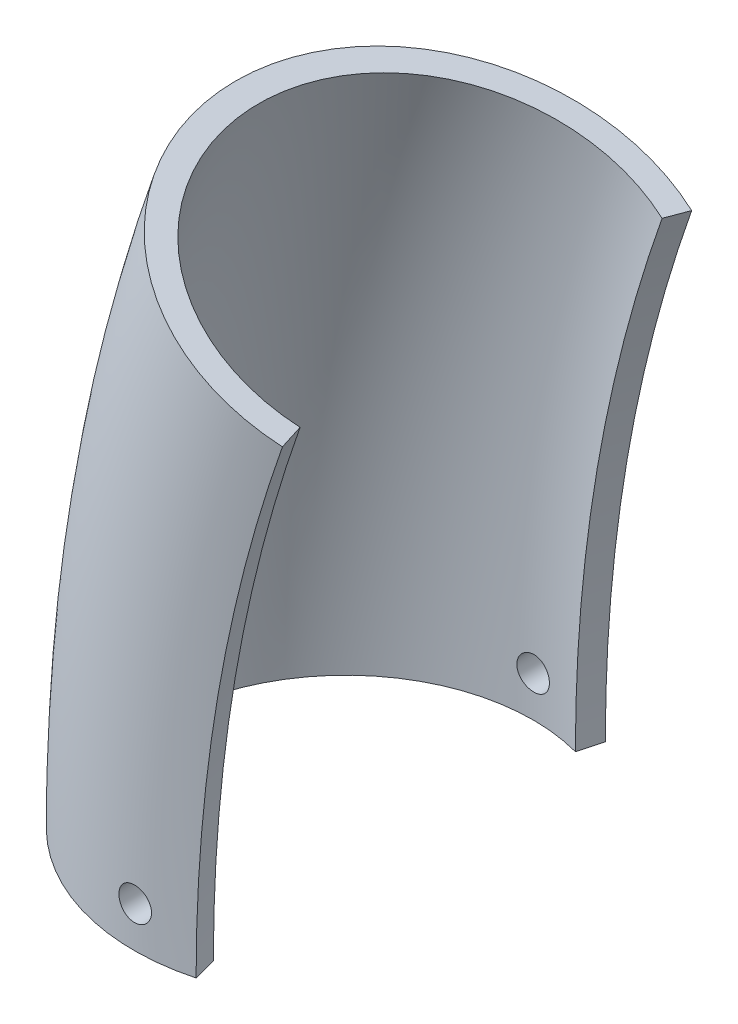
ISO-10303-21;
HEADER;
FILE_DESCRIPTION(('STEP AP214'),'2;1');
FILE_NAME('part.step','',(''),(''),'','','');
FILE_SCHEMA(('AUTOMOTIVE_DESIGN { 1 0 10303 214 1 1 1 1 }'));
ENDSEC;
DATA;
#1=APPLICATION_CONTEXT('core data for automotive mechanical design processes');
#2=APPLICATION_PROTOCOL_DEFINITION('international standard','automotive_design',2000,#1);
#3=PRODUCT_CONTEXT('',#1,'mechanical');
#4=PRODUCT('Part','Part','',(#3));
#5=PRODUCT_RELATED_PRODUCT_CATEGORY('part','',(#4));
#6=PRODUCT_DEFINITION_FORMATION('','',#4);
#7=PRODUCT_DEFINITION_CONTEXT('part definition',#1,'design');
#8=PRODUCT_DEFINITION('design','',#6,#7);
#9=PRODUCT_DEFINITION_SHAPE('','',#8);
#10=(LENGTH_UNIT() NAMED_UNIT(*) SI_UNIT(.MILLI.,.METRE.));
#11=(NAMED_UNIT(*) PLANE_ANGLE_UNIT() SI_UNIT($,.RADIAN.));
#12=(NAMED_UNIT(*) SI_UNIT($,.STERADIAN.) SOLID_ANGLE_UNIT());
#13=UNCERTAINTY_MEASURE_WITH_UNIT(LENGTH_MEASURE(1.E-05),#10,'distance_accuracy_value','');
#14=(GEOMETRIC_REPRESENTATION_CONTEXT(3) GLOBAL_UNCERTAINTY_ASSIGNED_CONTEXT((#13)) GLOBAL_UNIT_ASSIGNED_CONTEXT((#10,
#11,#12)) REPRESENTATION_CONTEXT('',''));
#15=CARTESIAN_POINT('',(0.,0.,0.));
#16=DIRECTION('',(0.,0.,1.));
#17=DIRECTION('',(1.,0.,0.));
#18=AXIS2_PLACEMENT_3D('',#15,#16,#17);
#19=CARTESIAN_POINT('',(0.,0.,0.));
#20=DIRECTION('',(0.,1.,0.));
#21=DIRECTION('',(0.,0.,1.));
#22=AXIS2_PLACEMENT_3D('',#19,#20,#21);
#23=PLANE('',#22);
#24=CARTESIAN_POINT('',(0.,0.,0.));
#25=DIRECTION('',(0.,-1.,0.));
#26=DIRECTION('',(0.,0.,1.));
#27=AXIS2_PLACEMENT_3D('',#24,#25,#26);
#28=CIRCLE('',#27,73.025);
#29=CARTESIAN_POINT('',(18.9002607686114,0.,70.5367334647593));
#30=VERTEX_POINT('',#29);
#31=CARTESIAN_POINT('',(18.9002607686114,0.,-70.5367334647593));
#32=VERTEX_POINT('',#31);
#33=EDGE_CURVE('E97',#30,#32,#28,.T.);
#34=ORIENTED_EDGE('',*,*,#33,.F.);
#35=DIRECTION('',(-0.258819045102518,0.,-0.965925826289069));
#36=VECTOR('',#35,1.);
#37=CARTESIAN_POINT('',(18.9002607686114,0.,70.5367334647593));
#38=LINE('',#37,#36);
#39=CARTESIAN_POINT('',(21.3655121732128,0.,79.7371769601627));
#40=VERTEX_POINT('',#39);
#41=EDGE_CURVE('E101',#40,#30,#38,.T.);
#42=ORIENTED_EDGE('',*,*,#41,.F.);
#43=CARTESIAN_POINT('',(0.,0.,0.));
#44=DIRECTION('',(0.,1.,0.));
#45=DIRECTION('',(0.,0.,1.));
#46=AXIS2_PLACEMENT_3D('',#43,#44,#45);
#47=CIRCLE('',#46,82.55);
#48=CARTESIAN_POINT('',(21.3655121732128,0.,-79.7371769601627));
#49=VERTEX_POINT('',#48);
#50=EDGE_CURVE('E104',#49,#40,#47,.T.);
#51=ORIENTED_EDGE('',*,*,#50,.F.);
#52=DIRECTION('',(0.258819045102518,0.,-0.965925826289069));
#53=VECTOR('',#52,1.);
#54=CARTESIAN_POINT('',(18.9002607686114,0.,-70.5367334647593));
#55=LINE('',#54,#53);
#56=EDGE_CURVE('E90',#32,#49,#55,.T.);
#57=ORIENTED_EDGE('',*,*,#56,.F.);
#58=EDGE_LOOP('',(#34,#42,#51,#57));
#59=FACE_BOUND('',#58,.T.);
#60=ADVANCED_FACE('F48',(#59),#23,.F.);
#61=CARTESIAN_POINT('',(34.8636082515742,203.2,0.));
#62=DIRECTION('',(0.333333333333333,0.942809041582063,0.));
#63=DIRECTION('',(0.,0.,1.));
#64=AXIS2_PLACEMENT_3D('',#61,#62,#63);
#65=PLANE('',#64);
#66=CARTESIAN_POINT('',(34.8636082515742,203.2,0.));
#67=DIRECTION('',(-0.333333333333333,-0.942809041582063,0.));
#68=DIRECTION('',(0.,0.,1.));
#69=AXIS2_PLACEMENT_3D('',#66,#67,#68);
#70=CIRCLE('',#69,73.025);
#71=CARTESIAN_POINT('',(52.6829449924797,196.89991307713,70.5367334647593));
#72=VERTEX_POINT('',#71);
#73=CARTESIAN_POINT('',(52.6829449924797,196.89991307713,-70.5367334647593));
#74=VERTEX_POINT('',#73);
#75=EDGE_CURVE('E72',#72,#74,#70,.T.);
#76=ORIENTED_EDGE('',*,*,#75,.T.);
#77=DIRECTION('',(0.24401693585629,-0.0862730150341727,-0.965925826289069));
#78=VECTOR('',#77,1.);
#79=CARTESIAN_POINT('',(52.6829449924798,196.89991307713,-70.5367334647593));
#80=LINE('',#79,#78);
#81=CARTESIAN_POINT('',(55.0072063065109,196.078162608929,-79.7371769601627));
#82=VERTEX_POINT('',#81);
#83=EDGE_CURVE('E11',#74,#82,#80,.T.);
#84=ORIENTED_EDGE('',*,*,#83,.T.);
#85=CARTESIAN_POINT('',(34.8636082515742,203.2,0.));
#86=DIRECTION('',(0.333333333333333,0.942809041582063,0.));
#87=DIRECTION('',(0.,0.,1.));
#88=AXIS2_PLACEMENT_3D('',#85,#86,#87);
#89=CIRCLE('',#88,82.55);
#90=CARTESIAN_POINT('',(55.0072063065109,196.078162608929,79.7371769601627));
#91=VERTEX_POINT('',#90);
#92=EDGE_CURVE('E122',#82,#91,#89,.T.);
#93=ORIENTED_EDGE('',*,*,#92,.T.);
#94=DIRECTION('',(-0.24401693585629,0.0862730150341728,-0.965925826289069));
#95=VECTOR('',#94,1.);
#96=CARTESIAN_POINT('',(52.6829449924798,196.89991307713,70.5367334647593));
#97=LINE('',#96,#95);
#98=EDGE_CURVE('E78',#91,#72,#97,.T.);
#99=ORIENTED_EDGE('',*,*,#98,.T.);
#100=EDGE_LOOP('',(#76,#84,#93,#99));
#101=FACE_BOUND('',#100,.T.);
#102=ADVANCED_FACE('F184',(#101),#65,.T.);
#103=CARTESIAN_POINT('',(609.6,0.,0.));
#104=DIRECTION('',(0.,0.,-1.));
#105=DIRECTION('',(-1.,0.,0.));
#106=AXIS2_PLACEMENT_3D('',#103,#104,#105);
#107=TOROIDAL_SURFACE('',#106,609.6,82.55);
#108=CARTESIAN_POINT('',(-4.32866974903977,11.4306157597218,-82.4307747753706));
#109=CARTESIAN_POINT('',(-4.45349599501136,11.5579964452513,-82.423932353531));
#110=CARTESIAN_POINT('',(-4.57293425013868,11.690622181437,-82.4170770402688));
#111=CARTESIAN_POINT('',(-4.80026798103986,11.9655023488514,-82.4035289042621));
#112=CARTESIAN_POINT('',(-4.908160583175,12.1077591628758,-82.3968361222894));
#113=CARTESIAN_POINT('',(-5.11167746680809,12.4009811623383,-82.3837977144483));
#114=CARTESIAN_POINT('',(-5.20729142461335,12.5519535230889,-82.3774523832487));
#115=CARTESIAN_POINT('',(-5.38550073157508,12.8614907400153,-82.3652908810197));
#116=CARTESIAN_POINT('',(-5.46809132723144,13.0200583410328,-82.3594749035292));
#117=CARTESIAN_POINT('',(-5.61956547891059,13.3434942206817,-82.3485424190019));
#118=CARTESIAN_POINT('',(-5.68845886752114,13.5083578775802,-82.3434254110391));
#119=CARTESIAN_POINT('',(-5.81214137858058,13.8433862842894,-82.33402817327));
#120=CARTESIAN_POINT('',(-5.86692529326976,14.0135529655251,-82.3297482525696));
#121=CARTESIAN_POINT('',(-5.96193061228865,14.3578122393139,-82.3221505752256));
#122=CARTESIAN_POINT('',(-6.00216096947484,14.5319023480396,-82.3188322273057));
#123=CARTESIAN_POINT('',(-6.06782699775818,14.8829342212113,-82.3132467080471));
#124=CARTESIAN_POINT('',(-6.09325721612157,15.0598770120127,-82.3109799241926));
#125=CARTESIAN_POINT('',(-6.12907651595348,15.4149086036543,-82.3075670011064));
#126=CARTESIAN_POINT('',(-6.13949748455716,15.5929941651876,-82.3064184877982));
#127=CARTESIAN_POINT('',(-6.14532528711514,15.9494804616701,-82.3052658234617));
#128=CARTESIAN_POINT('',(-6.14072657944947,16.1278812886699,-82.3052620948583));
#129=CARTESIAN_POINT('',(-6.11653971010502,16.4835991890116,-82.3063999745408));
#130=CARTESIAN_POINT('',(-6.09695664335805,16.6609166100773,-82.3075411935664));
#131=CARTESIAN_POINT('',(-6.04293871742971,17.0133306632782,-82.3109368765231));
#132=CARTESIAN_POINT('',(-6.00849837630483,17.1884264511174,-82.3131917514085));
#133=CARTESIAN_POINT('',(-5.92508571163942,17.5347821981685,-82.3187466678352));
#134=CARTESIAN_POINT('',(-5.87613881116522,17.7060483089004,-82.3220448815775));
#135=CARTESIAN_POINT('',(-5.76402493282343,18.0439060141497,-82.3295964145516));
#136=CARTESIAN_POINT('',(-5.70085272202916,18.2104958630291,-82.3338500852565));
#137=CARTESIAN_POINT('',(-5.5607644220864,18.5377108121363,-82.3431918058656));
#138=CARTESIAN_POINT('',(-5.48385330670053,18.6983380456192,-82.3482795537622));
#139=CARTESIAN_POINT('',(-5.31683196415711,19.01257313007,-82.3591473132793));
#140=CARTESIAN_POINT('',(-5.22671686315961,19.1661783614976,-82.3649275803775));
#141=CARTESIAN_POINT('',(-4.93717160401494,19.6152348205213,-82.3830883717606));
#142=CARTESIAN_POINT('',(-4.71865174392845,19.8986698511481,-82.3962811754801));
#143=CARTESIAN_POINT('',(-4.23732823759203,20.4247303021176,-82.4233435328099));
#144=CARTESIAN_POINT('',(-3.97452400123697,20.6673551785645,-82.4372130954365));
#145=CARTESIAN_POINT('',(-3.41128757208801,21.1056696475768,-82.4641205177042));
#146=CARTESIAN_POINT('',(-3.11077390362521,21.3012548527819,-82.4771564812989));
#147=CARTESIAN_POINT('',(-2.48109399033172,21.6391775688171,-82.5008995807081));
#148=CARTESIAN_POINT('',(-2.15192788677827,21.7815153421771,-82.5116067280043));
#149=CARTESIAN_POINT('',(-1.47455384404525,22.0087793642633,-82.5294764998027));
#150=CARTESIAN_POINT('',(-1.12636233798533,22.0937543383445,-82.536642131165));
#151=CARTESIAN_POINT('',(-0.420595515642418,22.2040214508361,-82.5466263332644));
#152=CARTESIAN_POINT('',(-0.0630203720252275,22.2293146866567,-82.5494449839323));
#153=CARTESIAN_POINT('',(0.650370291559263,22.2194951258999,-82.5504043967984));
#154=CARTESIAN_POINT('',(1.00618796869224,22.1845395967127,-82.5485573320599));
#155=CARTESIAN_POINT('',(1.70688820866638,22.0555310457813,-82.540406856769));
#156=CARTESIAN_POINT('',(2.05177079237753,21.9614781368336,-82.5341034547223));
#157=CARTESIAN_POINT('',(2.72072071579783,21.7170185159034,-82.5177420220277));
#158=CARTESIAN_POINT('',(3.04479480676612,21.5666301911261,-82.5076852164499));
#159=CARTESIAN_POINT('',(3.66313162433366,21.2137806772622,-82.4849401876146));
#160=CARTESIAN_POINT('',(3.95739384447539,21.01131860373,-82.4722519196639));
#161=CARTESIAN_POINT('',(4.50854072734592,20.5594757366249,-82.4456341549783));
#162=CARTESIAN_POINT('',(4.76533061900134,20.3099795167002,-82.4317016499979));
#163=CARTESIAN_POINT('',(5.23342944172025,19.7714331071113,-82.4041993450182));
#164=CARTESIAN_POINT('',(5.44473792506236,19.4823825281177,-82.3906295485906));
#165=CARTESIAN_POINT('',(5.81616327209498,18.8724253980708,-82.3653784114299));
#166=CARTESIAN_POINT('',(5.97620650217115,18.5514738855585,-82.3536997988441));
#167=CARTESIAN_POINT('',(6.2401049821455,17.8871512944842,-82.3335952075076));
#168=CARTESIAN_POINT('',(6.34396100846702,17.5437805257963,-82.3251691838114));
#169=CARTESIAN_POINT('',(6.49234271193337,16.8450620908956,-82.3125542291682));
#170=CARTESIAN_POINT('',(6.53698171165381,16.4897386390167,-82.3083572089654));
#171=CARTESIAN_POINT('',(6.56599854086009,15.7766171072048,-82.3046566186948));
#172=CARTESIAN_POINT('',(6.55037727256438,15.4188190644015,-82.3051529783577));
#173=CARTESIAN_POINT('',(6.45943273351659,14.7117641901717,-82.3107748962818));
#174=CARTESIAN_POINT('',(6.38424506758292,14.3624898138029,-82.3158899436443));
#175=CARTESIAN_POINT('',(6.17648547747823,13.6815228137756,-82.3301474635966));
#176=CARTESIAN_POINT('',(6.04391320809156,13.3498302958999,-82.339289960415));
#177=CARTESIAN_POINT('',(5.72506712987742,12.7131100005873,-82.3605649907169));
#178=CARTESIAN_POINT('',(5.53874148051283,12.4081083360577,-82.3727004089697));
#179=CARTESIAN_POINT('',(5.1175258518709,11.8335403219248,-82.3985834505632));
#180=CARTESIAN_POINT('',(4.88263491328413,11.5639746724607,-82.4123311057481));
#181=CARTESIAN_POINT('',(4.49888972392682,11.1918393142398,-82.4329957923471));
#182=CARTESIAN_POINT('',(4.36546172081753,11.0729717681654,-82.4399041367886));
#183=CARTESIAN_POINT('',(4.08907781889291,10.8469017416686,-82.4535350309164));
#184=CARTESIAN_POINT('',(3.94612544169336,10.7396949878699,-82.4602576479885));
#185=CARTESIAN_POINT('',(3.65163892929388,10.5376701625698,-82.4733284770764));
#186=CARTESIAN_POINT('',(3.50010160545203,10.4428567380482,-82.4796765481665));
#187=CARTESIAN_POINT('',(3.18961361906801,10.2663601757284,-82.4918132766045));
#188=CARTESIAN_POINT('',(3.03066572891573,10.1846721775903,-82.4976021407084));
#189=CARTESIAN_POINT('',(2.70633961112467,10.0349290994089,-82.5084618004921));
#190=CARTESIAN_POINT('',(2.54095776656495,9.96688182385363,-82.5135321846128));
#191=CARTESIAN_POINT('',(2.20508603529255,9.84498999222211,-82.5228055466132));
#192=CARTESIAN_POINT('',(2.03459806964054,9.7911401676083,-82.5270088461333));
#193=CARTESIAN_POINT('',(1.6896140508986,9.69798452745115,-82.5344328800551));
#194=CARTESIAN_POINT('',(1.51511673108588,9.65868337746059,-82.537653299203));
#195=CARTESIAN_POINT('',(1.16347869088376,9.59494677947494,-82.5430181751958));
#196=CARTESIAN_POINT('',(0.986338980970456,9.57050579091745,-82.5451630330077));
#197=CARTESIAN_POINT('',(0.631025428606752,9.53668335544785,-82.5483152926069));
#198=CARTESIAN_POINT('',(0.452854865053528,9.52726769795267,-82.549325276786));
#199=CARTESIAN_POINT('',(0.0964165492174945,9.52345826282207,-82.5501892612614));
#200=CARTESIAN_POINT('',(-0.0818511424097894,9.52905890846177,-82.5500436906658));
#201=CARTESIAN_POINT('',(-0.437385422794162,9.55523791775793,-82.5486027903748));
#202=CARTESIAN_POINT('',(-0.614651352537175,9.57582519421733,-82.5473067763905));
#203=CARTESIAN_POINT('',(-0.966746169785933,9.63182823904427,-82.5436029222853));
#204=CARTESIAN_POINT('',(-1.14157593043828,9.66723854567225,-82.5411954916467));
#205=CARTESIAN_POINT('',(-1.48754388783043,9.75261235620044,-82.5353396654393));
#206=CARTESIAN_POINT('',(-1.65868371021568,9.80256930463214,-82.5318917387463));
#207=CARTESIAN_POINT('',(-1.99607726150443,9.91666170072117,-82.5240544360274));
#208=CARTESIAN_POINT('',(-2.16233274372493,9.98079198838541,-82.5196654026411));
#209=CARTESIAN_POINT('',(-2.48871730897951,10.1227270219954,-82.5100733265165));
#210=CARTESIAN_POINT('',(-2.64885129835386,10.2005205247505,-82.5048709534431));
#211=CARTESIAN_POINT('',(-2.96195864479264,10.3692329784696,-82.4937982719921));
#212=CARTESIAN_POINT('',(-3.11493374314078,10.4601487154587,-82.4879281272435));
#213=CARTESIAN_POINT('',(-3.45641727025332,10.683022223844,-82.4738846603695));
#214=CARTESIAN_POINT('',(-3.64218650943381,10.8191962789997,-82.4655408253686));
#215=CARTESIAN_POINT('',(-3.99784575010048,11.1108793346777,-82.4483967287713));
#216=CARTESIAN_POINT('',(-4.16773571590569,11.2663883786442,-82.4395964661494));
#217=CARTESIAN_POINT('',(-4.32866974903977,11.4306157597218,-82.4307747753706));
#218=B_SPLINE_CURVE_WITH_KNOTS('',3,(#108,#109,#110,#111,#112,#113,#114,#115,#116,#117,#118,
#119,#120,#121,#122,#123,#124,#125,#126,#127,#128,#129,#130,#131,#132,#133,#134,#135,#136,#137,
#138,#139,#140,#141,#142,#143,#144,#145,#146,#147,#148,#149,#150,#151,#152,#153,#154,#155,#156,
#157,#158,#159,#160,#161,#162,#163,#164,#165,#166,#167,#168,#169,#170,#171,#172,#173,#174,#175,
#176,#177,#178,#179,#180,#181,#182,#183,#184,#185,#186,#187,#188,#189,#190,#191,#192,#193,#194,
#195,#196,#197,#198,#199,#200,#201,#202,#203,#204,#205,#206,#207,#208,#209,#210,#211,#212,#213,
#214,#215,#216,#217),.UNSPECIFIED.,.T.,.F.,(4,2,2,2,2,2,2,2,2,2,2,2,2,2,2,2,2,2,2,2,2,2,2,2,2,2,
2,2,2,2,2,2,2,2,2,2,2,2,2,2,2,2,2,2,2,2,2,2,2,2,2,2,2,2,4),(0.,0.53523264512552,
1.07059819787699,1.60641097093246,2.14241886409263,2.67804058170519,3.21385971309624,
3.74934866389685,4.28503477725967,4.81958113877571,5.35432474737836,5.88888661499353,
6.42364589080655,6.95747347575495,7.49149775640109,8.02532909976707,8.55935798907173,
9.62824440685096,10.69714506905,11.7683963202716,12.8396422897487,13.9099771680235,
14.9802923651439,16.0478179472103,17.1153414917476,18.1825169125378,19.2497104599464,
20.3195579261057,21.3894159234183,22.460803765895,23.5321768030121,24.6014966005761,
25.6708003883156,26.7376768425387,27.8045597149914,28.8724749641629,29.9404113098641,
30.476380904543,31.0121534138134,31.5481262425785,32.0839001411383,32.6199797112438,
33.1558600664757,33.6919121223402,34.2277641901946,34.7623944478632,35.2968261831108,
35.8315760138865,36.3661289822771,36.9004414253198,37.4345596642938,37.9682404296811,
38.5017907039454,39.1918455399953,39.8819019265718),.UNSPECIFIED.);
#219=CARTESIAN_POINT('',(-4.32866974903977,11.4306157597218,-82.4307747753706));
#220=VERTEX_POINT('',#219);
#221=EDGE_CURVE('E110',#220,#220,#218,.T.);
#222=ORIENTED_EDGE('',*,*,#221,.F.);
#223=EDGE_LOOP('',(#222));
#224=FACE_BOUND('',#223,.T.);
#225=CARTESIAN_POINT('',(-4.32866974903977,11.4306157597218,82.4307747753706));
#226=CARTESIAN_POINT('',(-4.20386554285281,11.3032532550161,82.4376161195338));
#227=CARTESIAN_POINT('',(-4.07370915264304,11.1811689278601,82.4444427352151));
#228=CARTESIAN_POINT('',(-3.80353693762988,10.9483407096446,82.4578789632699));
#229=CARTESIAN_POINT('',(-3.66351867821838,10.8375996355812,82.4644885214636));
#230=CARTESIAN_POINT('',(-3.37452804506166,10.6282024821753,82.4773076845398));
#231=CARTESIAN_POINT('',(-3.22554831272686,10.5295565422118,82.4835169518178));
#232=CARTESIAN_POINT('',(-2.91973459753891,10.3451223839305,82.4953564996889));
#233=CARTESIAN_POINT('',(-2.76289777516811,10.2593388594105,82.5009865686849));
#234=CARTESIAN_POINT('',(-2.44264649486017,10.1013438391072,82.5115017175215));
#235=CARTESIAN_POINT('',(-2.27923681731165,10.0291226887141,82.5163873268479));
#236=CARTESIAN_POINT('',(-1.94683222653364,9.89867066108332,82.5252811610446));
#237=CARTESIAN_POINT('',(-1.77783527692896,9.84044495011079,82.5292890618698));
#238=CARTESIAN_POINT('',(-1.43562189932873,9.73846983439129,82.5363084307282));
#239=CARTESIAN_POINT('',(-1.26240813349206,9.69471153812948,82.539320510782));
#240=CARTESIAN_POINT('',(-0.912830750623504,9.62192502310858,82.5442659168761));
#241=CARTESIAN_POINT('',(-0.736465997259152,9.59290223409205,82.5461988452965));
#242=CARTESIAN_POINT('',(-0.382296209830087,9.54986852431569,82.5489249533563));
#243=CARTESIAN_POINT('',(-0.204495153725237,9.5358250156643,82.5497206084578));
#244=CARTESIAN_POINT('',(0.15172546588937,9.52273654079223,82.5501561650581));
#245=CARTESIAN_POINT('',(0.330145233393179,9.52369711015702,82.5497956400362));
#246=CARTESIAN_POINT('',(0.686205064737938,9.54062004248928,82.5479269165496));
#247=CARTESIAN_POINT('',(0.863845372359365,9.55657732053282,82.5464191071269));
#248=CARTESIAN_POINT('',(1.21720755335119,9.60337876423419,82.5422968023463));
#249=CARTESIAN_POINT('',(1.39292869386242,9.63422842656364,82.5396818984116));
#250=CARTESIAN_POINT('',(1.74086777072017,9.71053530121787,82.5334229676288));
#251=CARTESIAN_POINT('',(1.91309068922966,9.7559699250507,82.5297805332213));
#252=CARTESIAN_POINT('',(2.25315287853854,9.86115006164636,82.5215654354889));
#253=CARTESIAN_POINT('',(2.42099051064271,9.92090084159472,82.5169924298826));
#254=CARTESIAN_POINT('',(2.75098366204603,10.0542637798237,82.5070464495991));
#255=CARTESIAN_POINT('',(2.91314120387576,10.1278709434603,82.5016737633186));
#256=CARTESIAN_POINT('',(3.23070927374089,10.2884239141298,82.490279256792));
#257=CARTESIAN_POINT('',(3.3861172825927,10.3753746475237,82.4842571970465));
#258=CARTESIAN_POINT('',(3.84104401075744,10.655701854692,82.4654455210642));
#259=CARTESIAN_POINT('',(4.12893563440712,10.868419752767,82.4519208511392));
#260=CARTESIAN_POINT('',(4.66481512008995,11.3389868656405,82.4244603689872));
#261=CARTESIAN_POINT('',(4.91280247743841,11.5968366511533,82.4105245515628));
#262=CARTESIAN_POINT('',(5.36257954194343,12.151106127111,82.3837870773871));
#263=CARTESIAN_POINT('',(5.5642720309288,12.4476049704011,82.3709878413491));
#264=CARTESIAN_POINT('',(5.91499392635277,13.0703475366138,82.3480225075936));
#265=CARTESIAN_POINT('',(6.06402373468914,13.3965910325148,82.3378563897814));
#266=CARTESIAN_POINT('',(6.30501439419046,14.069174188503,82.3213367961655));
#267=CARTESIAN_POINT('',(6.39704298345651,14.4154894585135,82.314978795237));
#268=CARTESIAN_POINT('',(6.52164567675392,15.1187046610045,82.3067906560834));
#269=CARTESIAN_POINT('',(6.55422087906463,15.4756043978349,82.3049604342167));
#270=CARTESIAN_POINT('',(6.5589726576158,16.1888567132649,82.3060378642569));
#271=CARTESIAN_POINT('',(6.53130767490701,16.5452082662675,82.3089330825048));
#272=CARTESIAN_POINT('',(6.41670820821853,17.2481834294694,82.3191044822211));
#273=CARTESIAN_POINT('',(6.32977364990827,17.5948070274682,82.3263806691839));
#274=CARTESIAN_POINT('',(6.09912708097335,18.2685495649109,82.3444801560945));
#275=CARTESIAN_POINT('',(5.9554100750031,18.5956667853974,82.3553037681073));
#276=CARTESIAN_POINT('',(5.61529084894857,19.2211656953554,82.3792629852112));
#277=CARTESIAN_POINT('',(5.41888768054728,19.5195468674651,82.392398631916));
#278=CARTESIAN_POINT('',(4.97834765029522,20.0799538673932,82.4195281624148));
#279=CARTESIAN_POINT('',(4.73408507896275,20.3418807751286,82.4335242383301));
#280=CARTESIAN_POINT('',(4.2050460414408,20.8210518067363,82.4607556287768));
#281=CARTESIAN_POINT('',(3.92026929649931,21.0382956231477,82.473990938073));
#282=CARTESIAN_POINT('',(3.31790741535797,21.4221449088503,82.4982187583542));
#283=CARTESIAN_POINT('',(3.00028835420909,21.5886973012896,82.5092089146035));
#284=CARTESIAN_POINT('',(2.34149126241702,21.8660828500397,82.5276898911438));
#285=CARTESIAN_POINT('',(2.0003135915183,21.976916856967,82.5351807648559));
#286=CARTESIAN_POINT('',(1.30487563450881,22.1394903596757,82.5458127203978));
#287=CARTESIAN_POINT('',(0.950645424039574,22.1913578897491,82.5489632296541));
#288=CARTESIAN_POINT('',(0.238494991733322,22.2349331040473,82.550601304908));
#289=CARTESIAN_POINT('',(-0.119425183729418,22.2266415434137,82.5490889294362));
#290=CARTESIAN_POINT('',(-0.82805913868248,22.1502255368299,82.5415914180256));
#291=CARTESIAN_POINT('',(-1.1787855872684,22.0822175659576,82.5356149924705));
#292=CARTESIAN_POINT('',(-1.86383640682935,21.8884758732368,82.519878171777));
#293=CARTESIAN_POINT('',(-2.1981606488636,21.7627416976722,82.5101177468971));
#294=CARTESIAN_POINT('',(-2.84136588349639,21.4569881610287,82.4878961862178));
#295=CARTESIAN_POINT('',(-3.15021327968886,21.2768985336253,82.4754315605472));
#296=CARTESIAN_POINT('',(-3.73346145532907,20.867403261736,82.4491928655802));
#297=CARTESIAN_POINT('',(-4.00786159147461,20.6379966964737,82.4354187718379));
#298=CARTESIAN_POINT('',(-4.38786002051016,20.2618201825791,82.4149237504032));
#299=CARTESIAN_POINT('',(-4.5094476257733,20.1308211889093,82.4081077587441));
#300=CARTESIAN_POINT('',(-4.74115159799363,19.8590539557096,82.3947252919891));
#301=CARTESIAN_POINT('',(-4.85127217116564,19.718289330099,82.3881587259671));
#302=CARTESIAN_POINT('',(-5.05929797437223,19.4279229528921,82.3754569528031));
#303=CARTESIAN_POINT('',(-5.15719863914913,19.278317929167,82.369321907245));
#304=CARTESIAN_POINT('',(-5.34001839212757,18.9714248334749,82.3576600649098));
#305=CARTESIAN_POINT('',(-5.42494228956688,18.8141396364642,82.3521330430106));
#306=CARTESIAN_POINT('',(-5.5812599379444,18.4929119113134,82.3418390878621));
#307=CARTESIAN_POINT('',(-5.65265032562699,18.3289677405898,82.3370723435985));
#308=CARTESIAN_POINT('',(-5.78133825377443,17.9956853608542,82.3284365694418));
#309=CARTESIAN_POINT('',(-5.83864102376568,17.8263491798806,82.3245672064584));
#310=CARTESIAN_POINT('',(-5.93879029280482,17.4833759398638,82.3178320108771));
#311=CARTESIAN_POINT('',(-5.98163215795959,17.3097375212957,82.3149664999454));
#312=CARTESIAN_POINT('',(-6.05251066684615,16.9595176983533,82.3103225824469));
#313=CARTESIAN_POINT('',(-6.08055282469112,16.7829374153981,82.3085437709558));
#314=CARTESIAN_POINT('',(-6.12160574753487,16.428439982411,82.3061246165272));
#315=CARTESIAN_POINT('',(-6.13465074825601,16.2505268141799,82.3054816787914));
#316=CARTESIAN_POINT('',(-6.14572888442474,15.8942993519511,82.3053444213328));
#317=CARTESIAN_POINT('',(-6.14376758865834,15.7159852313013,82.305849675471));
#318=CARTESIAN_POINT('',(-6.12485542488061,15.3600538844683,82.3079943568677));
#319=CARTESIAN_POINT('',(-6.10789562148754,15.1824371371134,82.3096344600874));
#320=CARTESIAN_POINT('',(-6.05910669693193,14.8293381743075,82.3140025736038));
#321=CARTESIAN_POINT('',(-6.02728304629346,14.6538551978979,82.316730183598));
#322=CARTESIAN_POINT('',(-5.94900633409018,14.3062387588628,82.3231960150189));
#323=CARTESIAN_POINT('',(-5.90255618961666,14.1341046356078,82.3269340349095));
#324=CARTESIAN_POINT('',(-5.79537925757252,13.794432585274,82.3353144454052));
#325=CARTESIAN_POINT('',(-5.73465766147786,13.6268930115414,82.3399565070453));
#326=CARTESIAN_POINT('',(-5.59941620738924,13.2976597373973,82.3500119204303));
#327=CARTESIAN_POINT('',(-5.52490767668652,13.1359613672934,82.3554246381716));
#328=CARTESIAN_POINT('',(-5.36261985080703,12.8194555317936,82.3668709140255));
#329=CARTESIAN_POINT('',(-5.2748438019018,12.6646463927145,82.3729043201541));
#330=CARTESIAN_POINT('',(-5.05890082898661,12.3185335395156,82.3872695050627));
#331=CARTESIAN_POINT('',(-4.9264479093917,12.12989078281,82.395755289254));
#332=CARTESIAN_POINT('',(-4.64185740485656,11.7681075270216,82.4130938153844));
#333=CARTESIAN_POINT('',(-4.48971977185941,11.5949670657867,82.4219465582193));
#334=CARTESIAN_POINT('',(-4.32866974903977,11.4306157597218,82.4307747753706));
#335=B_SPLINE_CURVE_WITH_KNOTS('',3,(#225,#226,#227,#228,#229,#230,#231,#232,#233,#234,#235,
#236,#237,#238,#239,#240,#241,#242,#243,#244,#245,#246,#247,#248,#249,#250,#251,#252,#253,#254,
#255,#256,#257,#258,#259,#260,#261,#262,#263,#264,#265,#266,#267,#268,#269,#270,#271,#272,#273,
#274,#275,#276,#277,#278,#279,#280,#281,#282,#283,#284,#285,#286,#287,#288,#289,#290,#291,#292,
#293,#294,#295,#296,#297,#298,#299,#300,#301,#302,#303,#304,#305,#306,#307,#308,#309,#310,#311,
#312,#313,#314,#315,#316,#317,#318,#319,#320,#321,#322,#323,#324,#325,#326,#327,#328,#329,#330,
#331,#332,#333,#334),.UNSPECIFIED.,.T.,.F.,(4,2,2,2,2,2,2,2,2,2,2,2,2,2,2,2,2,2,2,2,2,2,2,2,2,2,
2,2,2,2,2,2,2,2,2,2,2,2,2,2,2,2,2,2,2,2,2,2,2,2,2,2,2,2,4),(0.,0.535147284091362,
1.07042714667205,1.60615271136777,2.14207330158749,2.6776109291759,3.21334594212893,
3.74875108348348,4.28435336810651,4.81878804166842,5.3534198935359,5.88787053351866,
6.42251858637485,6.95634256478675,7.49036324958095,8.02419180967371,8.55821793213028,
9.62732471299562,10.6964450142049,11.7677903117852,12.8391274331658,13.9091889628664,
14.9792307251755,16.0464615114805,17.1136936362127,18.1810196699078,19.2483649160737,
20.3185522160093,21.3887468795725,22.460058274123,23.5313533131603,24.6003177729054,
25.6692688145911,26.7361395189218,27.8030186087782,28.8712828238688,29.9395669858147,
30.475624185747,31.0114840570515,31.5475435258072,32.0834038445849,32.619397157643,
33.1551912008146,33.691156772706,34.2269225119333,34.761462753676,35.2958046389616,
35.8304650737768,36.3649288858226,36.8992861724548,37.4334493778408,37.9671756499186,
38.5007715416153,39.1913353818667,39.8819009080451),.UNSPECIFIED.);
#336=CARTESIAN_POINT('',(-4.32866974903977,11.4306157597218,82.4307747753706));
#337=VERTEX_POINT('',#336);
#338=EDGE_CURVE('E165',#337,#337,#335,.T.);
#339=ORIENTED_EDGE('',*,*,#338,.F.);
#340=EDGE_LOOP('',(#339));
#341=FACE_BOUND('',#340,.T.);
#342=CARTESIAN_POINT('',(609.6,0.,79.7371769601627));
#343=DIRECTION('',(0.,0.,-1.));
#344=DIRECTION('',(-1.,0.,0.));
#345=AXIS2_PLACEMENT_3D('',#342,#343,#344);
#346=CIRCLE('',#345,588.234487826787);
#347=EDGE_CURVE('E128',#40,#91,#346,.T.);
#348=ORIENTED_EDGE('',*,*,#347,.T.);
#349=ORIENTED_EDGE('',*,*,#92,.F.);
#350=CARTESIAN_POINT('',(609.6,0.,-79.7371769601627));
#351=DIRECTION('',(0.,0.,-1.));
#352=DIRECTION('',(-1.,0.,0.));
#353=AXIS2_PLACEMENT_3D('',#350,#351,#352);
#354=CIRCLE('',#353,588.234487826787);
#355=EDGE_CURVE('E116',#49,#82,#354,.T.);
#356=ORIENTED_EDGE('',*,*,#355,.F.);
#357=ORIENTED_EDGE('',*,*,#50,.T.);
#358=EDGE_LOOP('',(#348,#349,#356,#357));
#359=FACE_BOUND('',#358,.T.);
#360=ADVANCED_FACE('F121',(#224,#341,#359),#107,.T.);
#361=CARTESIAN_POINT('',(609.6,0.,79.7371769601627));
#362=DIRECTION('',(0.,0.,-1.));
#363=DIRECTION('',(-1.,0.,0.));
#364=AXIS2_PLACEMENT_3D('',#361,#362,#363);
#365=CONICAL_SURFACE('',#364,588.234487826787,0.26179938779915);
#366=CARTESIAN_POINT('',(609.6,0.,70.5367334647593));
#367=DIRECTION('',(0.,0.,-1.));
#368=DIRECTION('',(-1.,0.,0.));
#369=AXIS2_PLACEMENT_3D('',#366,#367,#368);
#370=CIRCLE('',#369,590.699739231389);
#371=EDGE_CURVE('E136',#30,#72,#370,.T.);
#372=ORIENTED_EDGE('',*,*,#371,.T.);
#373=ORIENTED_EDGE('',*,*,#98,.F.);
#374=ORIENTED_EDGE('',*,*,#347,.F.);
#375=ORIENTED_EDGE('',*,*,#41,.T.);
#376=EDGE_LOOP('',(#372,#373,#374,#375));
#377=FACE_BOUND('',#376,.T.);
#378=ADVANCED_FACE('F183',(#377),#365,.F.);
#379=CARTESIAN_POINT('',(609.6,0.,0.));
#380=DIRECTION('',(0.,0.,-1.));
#381=DIRECTION('',(-1.,0.,0.));
#382=AXIS2_PLACEMENT_3D('',#379,#380,#381);
#383=TOROIDAL_SURFACE('',#382,609.6,73.025);
#384=CARTESIAN_POINT('',(-4.3280450445329,11.4299783501334,-72.890235286837));
#385=CARTESIAN_POINT('',(-4.20324019490902,11.3026509002933,-72.89797097357));
#386=CARTESIAN_POINT('',(-4.07308589367177,11.1806015023238,-72.9056895210043));
#387=CARTESIAN_POINT('',(-3.80292045157217,10.9478398892939,-72.9208805344418));
#388=CARTESIAN_POINT('',(-3.66290691831508,10.8371304420409,-72.9283529400672));
#389=CARTESIAN_POINT('',(-3.37392843682872,10.6277940744812,-72.9428449021984));
#390=CARTESIAN_POINT('',(-3.22495627617521,10.5291770890585,-72.9498640841345));
#391=CARTESIAN_POINT('',(-2.91915619395689,10.3447960457734,-72.9632475110213));
#392=CARTESIAN_POINT('',(-2.76232543597239,10.2590366738725,-72.9696115169293));
#393=CARTESIAN_POINT('',(-2.44207732438314,10.101082921403,-72.9814972792996));
#394=CARTESIAN_POINT('',(-2.27866451051442,10.0288793793717,-72.9870196041185));
#395=CARTESIAN_POINT('',(-1.9462493362322,9.89846068572298,-72.9970721257488));
#396=CARTESIAN_POINT('',(-1.77724493802218,9.84025069924514,-73.0016019561678));
#397=CARTESIAN_POINT('',(-1.43501250200532,9.73830663264072,-73.009534942647));
#398=CARTESIAN_POINT('',(-1.26178712669866,9.69456366846734,-73.0129387901618));
#399=CARTESIAN_POINT('',(-0.912183578333624,9.62180891575792,-73.0185267557565));
#400=CARTESIAN_POINT('',(-0.735804268578434,9.59280255385782,-73.0207104245448));
#401=CARTESIAN_POINT('',(-0.381698513311516,9.54981519845575,-73.0237882819806));
#402=CARTESIAN_POINT('',(-0.203977015574492,9.5357936883247,-73.0246859500194));
#403=CARTESIAN_POINT('',(0.152083327163788,9.52273571640821,-73.0251759582615));
#404=CARTESIAN_POINT('',(0.33042237570025,9.52370478394238,-73.024767816857));
#405=CARTESIAN_POINT('',(0.686318837261738,9.54063095240092,-73.0226553573186));
#406=CARTESIAN_POINT('',(0.863876496378759,9.55658293566731,-73.0209514818017));
#407=CARTESIAN_POINT('',(1.21707180110922,9.60335929136763,-73.0162938484694));
#408=CARTESIAN_POINT('',(1.39270871320067,9.63418915577609,-73.0133396291556));
#409=CARTESIAN_POINT('',(1.74042310838267,9.71042884126641,-73.0062700011484));
#410=CARTESIAN_POINT('',(1.91250660079058,9.75581145510692,-73.0021567610409));
#411=CARTESIAN_POINT('',(2.25229333005521,9.86086210138835,-72.992880197839));
#412=CARTESIAN_POINT('',(2.41999493036622,9.92053538885179,-72.9877164885673));
#413=CARTESIAN_POINT('',(2.74972328131851,10.0537177961653,-72.9764857803087));
#414=CARTESIAN_POINT('',(2.91175203502293,10.1272219727274,-72.9704191042118));
#415=CARTESIAN_POINT('',(3.2290732597288,10.2875438465919,-72.9575524196757));
#416=CARTESIAN_POINT('',(3.38436321389895,10.374366464137,-72.9507521404975));
#417=CARTESIAN_POINT('',(3.83912987703414,10.6543785479752,-72.9295002869736));
#418=CARTESIAN_POINT('',(4.12698434162412,10.8669021454921,-72.9142162667795));
#419=CARTESIAN_POINT('',(4.66283864942895,11.3370565571663,-72.8831772311235));
#420=CARTESIAN_POINT('',(4.9108378258814,11.5946881258106,-72.8674222077872));
#421=CARTESIAN_POINT('',(5.36083345739777,12.1486836152146,-72.8371773855891));
#422=CARTESIAN_POINT('',(5.56270568331423,12.4451488257401,-72.8226910667559));
#423=CARTESIAN_POINT('',(5.91378726005625,13.0678824062458,-72.7966918747069));
#424=CARTESIAN_POINT('',(6.06299713950346,13.3941504770252,-72.7851789716445));
#425=CARTESIAN_POINT('',(6.30429053314834,14.0667330574084,-72.7664679370455));
#426=CARTESIAN_POINT('',(6.39646023801608,14.4130164527364,-72.7592632960593));
#427=CARTESIAN_POINT('',(6.52134653777312,15.1162063821768,-72.7499754567757));
#428=CARTESIAN_POINT('',(6.55406453357584,15.4731126657714,-72.7478921377996));
#429=CARTESIAN_POINT('',(6.55909284909415,16.1861363405799,-72.7490861988825));
#430=CARTESIAN_POINT('',(6.53160584873829,16.5422523510163,-72.7523455834494));
#431=CARTESIAN_POINT('',(6.41744466801477,17.2447825653114,-72.7638150533747));
#432=CARTESIAN_POINT('',(6.33077039511638,17.5911967540018,-72.7720251464727));
#433=CARTESIAN_POINT('',(6.10072676263502,18.264567657293,-72.7924546697925));
#434=CARTESIAN_POINT('',(5.95735138373089,18.591522301851,-72.8046745256623));
#435=CARTESIAN_POINT('',(5.61799163204301,19.2167653380022,-72.8317296074679));
#436=CARTESIAN_POINT('',(5.42200605248375,19.5150530718192,-72.846564893394));
#437=CARTESIAN_POINT('',(4.98219373307255,20.0755815352988,-72.8772227480784));
#438=CARTESIAN_POINT('',(4.73820641173267,20.3376961037298,-72.8930485056689));
#439=CARTESIAN_POINT('',(4.20968104182308,20.8172981153976,-72.9238479643377));
#440=CARTESIAN_POINT('',(3.9251426332629,21.0347851624138,-72.9388216578501));
#441=CARTESIAN_POINT('',(3.32310605851338,21.4192308430788,-72.9662457576724));
#442=CARTESIAN_POINT('',(3.00556415420938,21.5861212464404,-72.9786927492857));
#443=CARTESIAN_POINT('',(2.34683404909341,21.8641822759803,-72.9996344796743));
#444=CARTESIAN_POINT('',(2.00564630886583,21.9753539871258,-73.008129295407));
#445=CARTESIAN_POINT('',(1.31031837810987,22.1385286048486,-73.020198031655));
#446=CARTESIAN_POINT('',(0.956216724852421,22.1906947180677,-73.0237855313598));
#447=CARTESIAN_POINT('',(0.244268540386523,22.2348969915229,-73.0256922592369));
#448=CARTESIAN_POINT('',(-0.11357793020489,22.2269341235628,-73.0240115725539));
#449=CARTESIAN_POINT('',(-0.821915906622306,22.1512195840218,-73.0155959701083));
#450=CARTESIAN_POINT('',(-1.17242351786235,22.0836169458318,-73.008873659096));
#451=CARTESIAN_POINT('',(-1.85710352280992,21.8907722694765,-72.9911519093845));
#452=CARTESIAN_POINT('',(-2.1912757500969,21.7655296442258,-72.9801524271208));
#453=CARTESIAN_POINT('',(-2.83437926188559,21.4607848262218,-72.9550903703071));
#454=CARTESIAN_POINT('',(-3.14326811800417,21.28119370976,-72.9410227864187));
#455=CARTESIAN_POINT('',(-3.72669638873255,20.8727196500587,-72.9113941434744));
#456=CARTESIAN_POINT('',(-4.00123500032913,20.6438355548267,-72.8958330495192));
#457=CARTESIAN_POINT('',(-4.38161771846482,20.2683492653738,-72.8726608077742));
#458=CARTESIAN_POINT('',(-4.50340002396902,20.1375139767001,-72.8649487185536));
#459=CARTESIAN_POINT('',(-4.73550707312432,19.8660545246579,-72.8498025714882));
#460=CARTESIAN_POINT('',(-4.8458360146851,19.725433979591,-72.8423684124197));
#461=CARTESIAN_POINT('',(-5.05429125707844,19.4353333638961,-72.8279840401366));
#462=CARTESIAN_POINT('',(-5.15241299141223,19.2858500085402,-72.8210340084506));
#463=CARTESIAN_POINT('',(-5.33568523987712,18.9791755312881,-72.8078184389784));
#464=CARTESIAN_POINT('',(-5.42084056785948,18.8219872986619,-72.8015526474098));
#465=CARTESIAN_POINT('',(-5.57762738716281,18.5009300681962,-72.7898780309642));
#466=CARTESIAN_POINT('',(-5.64925576925408,18.3370595449013,-72.7844694031561));
#467=CARTESIAN_POINT('',(-5.77842446198629,18.0038975597153,-72.7746654141924));
#468=CARTESIAN_POINT('',(-5.83597001079049,17.8346081399786,-72.7702696763242));
#469=CARTESIAN_POINT('',(-5.93660618681587,17.4917022521181,-72.7626119837359));
#470=CARTESIAN_POINT('',(-5.97969222063011,17.3180844277552,-72.7593503892914));
#471=CARTESIAN_POINT('',(-6.05105704316369,16.9678806530816,-72.75405635266));
#472=CARTESIAN_POINT('',(-6.07934136238003,16.7912958368444,-72.7520234513414));
#473=CARTESIAN_POINT('',(-6.12085854838103,16.4368921478209,-72.7492466892869));
#474=CARTESIAN_POINT('',(-6.13413624559896,16.2590785557811,-72.7484989856769));
#475=CARTESIAN_POINT('',(-6.1456940634338,15.9030300173202,-72.7483018722047));
#476=CARTESIAN_POINT('',(-6.14397975675157,15.7247952520811,-72.7488519798754));
#477=CARTESIAN_POINT('',(-6.12557459908378,15.3690038297235,-72.7512346935396));
#478=CARTESIAN_POINT('',(-6.10887491150888,15.191447634793,-72.7530680561032));
#479=CARTESIAN_POINT('',(-6.06061802761323,14.8384499154895,-72.7579654798844));
#480=CARTESIAN_POINT('',(-6.02906629455005,14.6630076378393,-72.7610290885007));
#481=CARTESIAN_POINT('',(-5.9513564694679,14.3155062446826,-72.7682989242211));
#482=CARTESIAN_POINT('',(-5.90520580744957,14.1434454554048,-72.7725045699414));
#483=CARTESIAN_POINT('',(-5.79864675653577,13.8038958139567,-72.7819393081701));
#484=CARTESIAN_POINT('',(-5.73824354301069,13.6364053267953,-72.7871680290632));
#485=CARTESIAN_POINT('',(-5.60365467993643,13.3072399334315,-72.7984991465225));
#486=CARTESIAN_POINT('',(-5.52948006373955,13.145560494452,-72.804600842788));
#487=CARTESIAN_POINT('',(-5.36787472752461,12.8290623972125,-72.8175083226229));
#488=CARTESIAN_POINT('',(-5.28044718140096,12.6742421077219,-72.8243139374899));
#489=CARTESIAN_POINT('',(-5.06413262063947,12.3261598551177,-72.8406115696801));
#490=CARTESIAN_POINT('',(-4.93075492653488,12.1356759851616,-72.8502872055391));
#491=CARTESIAN_POINT('',(-4.64395576713155,11.7704719478398,-72.8700633396902));
#492=CARTESIAN_POINT('',(-4.49053423658266,11.595751831794,-72.8801638393655));
#493=CARTESIAN_POINT('',(-4.3280450445329,11.4299783501334,-72.890235286837));
#494=B_SPLINE_CURVE_WITH_KNOTS('',3,(#384,#385,#386,#387,#388,#389,#390,#391,#392,#393,#394,
#395,#396,#397,#398,#399,#400,#401,#402,#403,#404,#405,#406,#407,#408,#409,#410,#411,#412,#413,
#414,#415,#416,#417,#418,#419,#420,#421,#422,#423,#424,#425,#426,#427,#428,#429,#430,#431,#432,
#433,#434,#435,#436,#437,#438,#439,#440,#441,#442,#443,#444,#445,#446,#447,#448,#449,#450,#451,
#452,#453,#454,#455,#456,#457,#458,#459,#460,#461,#462,#463,#464,#465,#466,#467,#468,#469,#470,
#471,#472,#473,#474,#475,#476,#477,#478,#479,#480,#481,#482,#483,#484,#485,#486,#487,#488,#489,
#490,#491,#492,#493),.UNSPECIFIED.,.T.,.F.,(4,2,2,2,2,2,2,2,2,2,2,2,2,2,2,2,2,2,2,2,2,2,2,2,2,2,
2,2,2,2,2,2,2,2,2,2,2,2,2,2,2,2,2,2,2,2,2,2,2,2,2,2,2,2,4),(0.,0.535181633121162,
1.07049358140861,1.6062424239324,2.14218604813235,2.67776615030055,3.21354363712254,
3.74899149503639,4.28463638468541,4.81882928376758,5.35321922620221,5.88742670543361,
6.42183153135888,6.95524302390607,7.48885096661952,8.02226855392052,8.55588367883263,
9.62477366399777,10.6936815293869,11.7654351103183,12.8371779327421,13.9072973163579,
14.9773914834732,16.0438887205581,17.1103876249608,18.1769997780082,19.2436363991513,
20.3139038767082,21.3841808561089,22.4558947643107,23.5275878030432,24.5963092858158,
25.6650134959617,26.7310546695134,27.7971067013464,28.8649125002258,29.9327432567742,
30.4689473658787,31.0049542453028,31.5411610362612,32.0771682695025,32.6132985568738,
33.1492291244235,33.6853297821904,34.2212299886,34.7555249922469,35.2896214007194,
35.8240329626296,36.3582480971058,36.8921917835853,37.4259418826034,37.9592661835165,
38.4924629617944,39.1892383541812,39.8860160148874),.UNSPECIFIED.);
#495=CARTESIAN_POINT('',(-4.3280450445329,11.4299783501334,-72.890235286837));
#496=VERTEX_POINT('',#495);
#497=EDGE_CURVE('E51',#496,#496,#494,.T.);
#498=ORIENTED_EDGE('',*,*,#497,.F.);
#499=EDGE_LOOP('',(#498));
#500=FACE_BOUND('',#499,.T.);
#501=CARTESIAN_POINT('',(-4.3280450445329,11.4299783501334,72.890235286837));
#502=CARTESIAN_POINT('',(-4.45287805880005,11.5573300415381,72.8824980095293));
#503=CARTESIAN_POINT('',(-4.57232399940809,11.6899258501432,72.8747457478806));
#504=CARTESIAN_POINT('',(-4.79967764529893,11.9647472140268,72.8594239865056));
#505=CARTESIAN_POINT('',(-4.90758252528674,12.1069751134235,72.8518545318808));
#506=CARTESIAN_POINT('',(-5.11112763344059,12.4001403986979,72.8371073020877));
#507=CARTESIAN_POINT('',(-5.20675773585973,12.5510848281162,72.8299298530623));
#508=CARTESIAN_POINT('',(-5.38500493005602,12.8605715988069,72.8161724126188));
#509=CARTESIAN_POINT('',(-5.46761727607014,13.0191166836343,72.8095926394585));
#510=CARTESIAN_POINT('',(-5.61914222950121,13.3425203780692,72.7972231443625));
#511=CARTESIAN_POINT('',(-5.68806419286795,13.5073745835233,72.7914328837315));
#512=CARTESIAN_POINT('',(-5.81180603887933,13.8423926060223,72.7807982803681));
#513=CARTESIAN_POINT('',(-5.86662071502972,14.0125583574632,72.7759542870273));
#514=CARTESIAN_POINT('',(-5.96168786802406,14.3568242738976,72.7673543893157));
#515=CARTESIAN_POINT('',(-6.00194929339314,14.530921951005,72.7635978165939));
#516=CARTESIAN_POINT('',(-6.06767594992465,14.8819763775647,72.7572737887972));
#517=CARTESIAN_POINT('',(-6.09313573146846,15.0589341554253,72.7547067717592));
#518=CARTESIAN_POINT('',(-6.12900181294805,15.4139089441206,72.750841730236));
#519=CARTESIAN_POINT('',(-6.13944777495453,15.5919219121091,72.7495403652276));
#520=CARTESIAN_POINT('',(-6.14533742919238,15.9482665848554,72.7482312681601));
#521=CARTESIAN_POINT('',(-6.14077558524473,16.1265983829752,72.7482240135355));
#522=CARTESIAN_POINT('',(-6.11667408008592,16.4821807291361,72.7495043258984));
#523=CARTESIAN_POINT('',(-6.097139551351,16.6594316267164,72.7507914492341));
#524=CARTESIAN_POINT('',(-6.04323066928116,17.0117152063712,72.7546242422858));
#525=CARTESIAN_POINT('',(-6.0088508381139,17.186747045061,72.7571703766201));
#526=CARTESIAN_POINT('',(-5.92558754697966,17.5329116666357,72.763442994796));
#527=CARTESIAN_POINT('',(-5.87673502916876,17.7040519374627,72.7671669616053));
#528=CARTESIAN_POINT('',(-5.76483391156589,18.0416654105904,72.7756937815848));
#529=CARTESIAN_POINT('',(-5.70178009055819,18.20813687099,72.7804970315602));
#530=CARTESIAN_POINT('',(-5.56195232143073,18.5351259471098,72.7910460890761));
#531=CARTESIAN_POINT('',(-5.48518330177891,18.695645676608,72.7967915579758));
#532=CARTESIAN_POINT('',(-5.31846925651211,19.0096798331219,72.8090646318241));
#533=CARTESIAN_POINT('',(-5.22851936254066,19.1631916441674,72.8155925255986));
#534=CARTESIAN_POINT('',(-4.93940434515313,19.612148005146,72.8361099976516));
#535=CARTESIAN_POINT('',(-4.72115669581168,19.895586888818,72.8510189027098));
#536=CARTESIAN_POINT('',(-4.240397491404,20.4217175008935,72.8816055933907));
#537=CARTESIAN_POINT('',(-3.97788515963823,20.6644085141568,72.8972833925014));
#538=CARTESIAN_POINT('',(-3.41505202503749,21.1030675507263,72.9277145102521));
#539=CARTESIAN_POINT('',(-3.11462688911839,21.2989021489144,72.9424651027344));
#540=CARTESIAN_POINT('',(-2.48505605885134,21.6373328050964,72.9693376653107));
#541=CARTESIAN_POINT('',(-2.15591055269312,21.7799292119003,72.9814596526267));
#542=CARTESIAN_POINT('',(-1.47858302779186,22.0076742594849,73.0016962791732));
#543=CARTESIAN_POINT('',(-1.13042196063882,22.0928848013742,73.009815233862));
#544=CARTESIAN_POINT('',(-0.424658937613235,22.203619165783,73.0211404520392));
#545=CARTESIAN_POINT('',(-0.0670572028002302,22.2291443846228,73.0243468304553));
#546=CARTESIAN_POINT('',(0.646167428732846,22.2197755909654,73.0254700942019));
#547=CARTESIAN_POINT('',(1.00179295018726,22.1850823995891,73.0234045499561));
#548=CARTESIAN_POINT('',(1.70215118403373,22.0566661271198,73.0142398663049));
#549=CARTESIAN_POINT('',(2.04688392391814,21.9629431950247,73.0071407396049));
#550=CARTESIAN_POINT('',(2.7155524854092,21.7192230730486,72.9886991888524));
#551=CARTESIAN_POINT('',(3.03949709019175,21.5692498352162,72.977358570883));
#552=CARTESIAN_POINT('',(3.657656107608,21.2173017507147,72.9516981363967));
#553=CARTESIAN_POINT('',(3.95186987833178,21.0153257816035,72.9373782555759));
#554=CARTESIAN_POINT('',(4.50321872471036,20.5643516104749,72.9073142000699));
#555=CARTESIAN_POINT('',(4.76023329172462,20.3152063627547,72.891565653839));
#556=CARTESIAN_POINT('',(5.22885144468071,19.7773246711941,72.8604637181415));
#557=CARTESIAN_POINT('',(5.44045445247742,19.4885877233792,72.8451103337079));
#558=CARTESIAN_POINT('',(5.8126141911521,18.8790668873436,72.8165183170949));
#559=CARTESIAN_POINT('',(5.97307622003216,18.5582249741627,72.8032836305724));
#560=CARTESIAN_POINT('',(6.23781572811097,17.8940200678306,72.7804846586318));
#561=CARTESIAN_POINT('',(6.34209419756003,17.5506574717321,72.7709203085238));
#562=CARTESIAN_POINT('',(6.49125791869187,16.8520423682662,72.7565859032226));
#563=CARTESIAN_POINT('',(6.53628731727415,16.4968208815758,72.7518042191247));
#564=CARTESIAN_POINT('',(6.56610320192426,15.7838294262803,72.7475478445786));
#565=CARTESIAN_POINT('',(6.55089085163443,15.4260595070346,72.7480730516215));
#566=CARTESIAN_POINT('',(6.46080094667994,14.7192286469694,72.7543597662163));
#567=CARTESIAN_POINT('',(6.38609729520508,14.3701453761736,72.7601060186543));
#568=CARTESIAN_POINT('',(6.17938538226831,13.6894794192461,72.7761531795783));
#569=CARTESIAN_POINT('',(6.04737666916326,13.3578968710675,72.7864541239616));
#570=CARTESIAN_POINT('',(5.72968765362964,12.7212136507147,72.8104448514332));
#571=CARTESIAN_POINT('',(5.54394194611238,12.4161458424864,72.8241387612796));
#572=CARTESIAN_POINT('',(5.12391073303955,11.8413330061653,72.8533603247344));
#573=CARTESIAN_POINT('',(4.88962402775242,11.5715888513952,72.8688880236625));
#574=CARTESIAN_POINT('',(4.50668205513249,11.1989929403173,72.8922457812833));
#575=CARTESIAN_POINT('',(4.37344969051158,11.0799011334851,72.900060262101));
#576=CARTESIAN_POINT('',(4.09743580464391,10.8533661070029,72.9154830157615));
#577=CARTESIAN_POINT('',(3.95465780897842,10.7459186246516,72.9230913632945));
#578=CARTESIAN_POINT('',(3.66049561488937,10.5433967626625,72.9378885079397));
#579=CARTESIAN_POINT('',(3.50910821126551,10.4483270350478,72.9450771467529));
#580=CARTESIAN_POINT('',(3.19889288822058,10.2713047056326,72.9588254467205));
#581=CARTESIAN_POINT('',(3.04006775545743,10.1893472411547,72.9653853406811));
#582=CARTESIAN_POINT('',(2.71594642337537,10.0390493388288,72.9776968512525));
#583=CARTESIAN_POINT('',(2.5506461413506,9.97071766319252,72.9834479470608));
#584=CARTESIAN_POINT('',(2.21490637602879,9.84825226820714,72.9939719084183));
#585=CARTESIAN_POINT('',(2.044468828998,9.79411327235008,72.998745137371));
#586=CARTESIAN_POINT('',(1.69955507307579,9.70037826019369,73.0071825232617));
#587=CARTESIAN_POINT('',(1.52507759797827,9.66078687087271,73.0108463272735));
#588=CARTESIAN_POINT('',(1.17344966762774,9.59647258967006,73.016958549032));
#589=CARTESIAN_POINT('',(0.996300237008083,9.57174413968412,73.0194074210515));
#590=CARTESIAN_POINT('',(0.64106440024275,9.53736544360672,73.023018209291));
#591=CARTESIAN_POINT('',(0.462982358295756,9.52767049265434,73.0241839381604));
#592=CARTESIAN_POINT('',(0.106696186192899,9.52329007475651,73.0252099272895));
#593=CARTESIAN_POINT('',(-0.0715078738998785,9.52859902547334,73.0250706730353));
#594=CARTESIAN_POINT('',(-0.426938048800887,9.55418390628351,73.0234930421647));
#595=CARTESIAN_POINT('',(-0.604163525959035,9.57446864778838,73.0220539006131));
#596=CARTESIAN_POINT('',(-0.956201308867781,9.62985758140824,73.0179186103671));
#597=CARTESIAN_POINT('',(-1.13101447880205,9.66495631632692,73.0152229245219));
#598=CARTESIAN_POINT('',(-1.47690761391214,9.74968313310701,73.0086551161712));
#599=CARTESIAN_POINT('',(-1.64799054635615,9.79929917744818,73.00478396824));
#600=CARTESIAN_POINT('',(-1.98529849080383,9.91269236459264,72.9959764662358));
#601=CARTESIAN_POINT('',(-2.15152524323218,9.97646436174993,72.9910404992396));
#602=CARTESIAN_POINT('',(-2.47788612961721,10.1176688422963,72.9802463247396));
#603=CARTESIAN_POINT('',(-2.63802502665454,10.1950903674157,72.9743888574482));
#604=CARTESIAN_POINT('',(-2.95117555518336,10.3630462065023,72.9619159057714));
#605=CARTESIAN_POINT('',(-3.10418888387699,10.4535773766203,72.9553006032032));
#606=CARTESIAN_POINT('',(-3.44764327056964,10.6767549664001,72.9393824970768));
#607=CARTESIAN_POINT('',(-3.63522764440913,10.8138159223471,72.9298763135062));
#608=CARTESIAN_POINT('',(-3.99425981843347,11.1076211566361,72.9103336301594));
#609=CARTESIAN_POINT('',(-4.16570756986574,11.2643654944431,72.900297128781));
#610=CARTESIAN_POINT('',(-4.3280450445329,11.4299783501334,72.890235286837));
#611=B_SPLINE_CURVE_WITH_KNOTS('',3,(#501,#502,#503,#504,#505,#506,#507,#508,#509,#510,#511,
#512,#513,#514,#515,#516,#517,#518,#519,#520,#521,#522,#523,#524,#525,#526,#527,#528,#529,#530,
#531,#532,#533,#534,#535,#536,#537,#538,#539,#540,#541,#542,#543,#544,#545,#546,#547,#548,#549,
#550,#551,#552,#553,#554,#555,#556,#557,#558,#559,#560,#561,#562,#563,#564,#565,#566,#567,#568,
#569,#570,#571,#572,#573,#574,#575,#576,#577,#578,#579,#580,#581,#582,#583,#584,#585,#586,#587,
#588,#589,#590,#591,#592,#593,#594,#595,#596,#597,#598,#599,#600,#601,#602,#603,#604,#605,#606,
#607,#608,#609,#610),.UNSPECIFIED.,.T.,.F.,(4,2,2,2,2,2,2,2,2,2,2,2,2,2,2,2,2,2,2,2,2,2,2,2,2,2,
2,2,2,2,2,2,2,2,2,2,2,2,2,2,2,2,2,2,2,2,2,2,2,2,2,2,2,2,4),(0.,0.535292901821886,
1.07071654686258,1.60657907477707,2.14263650741649,2.67832633067162,3.21421357524965,
3.7497707498826,4.28552497945713,4.81986128694728,5.35439472605743,5.88874501472226,
6.42329264432898,6.95670557535309,7.49031494071109,8.02373294126796,8.55734845871185,
9.62595505646378,10.6945804066975,11.7662134209275,12.8378394138284,13.9083076034448,
14.9787507495259,16.0456309522233,17.1125084620006,18.1789321974574,19.245378952847,
20.3152066909257,21.3850480484227,22.456859161804,23.5286513836089,24.5978311939264,
25.6669903518417,26.7330355972918,27.7990892448055,28.8664459202681,29.933828979496,
30.4699204314025,31.0058149657075,31.5419103313577,32.0778064230942,32.6140460251178,
33.1500859821024,33.6862962834503,34.2223059400943,34.7567185962723,35.290932445553,
35.8254608647507,36.3597925453685,36.8936824162764,37.4273785367042,37.9606481242223,
38.4937900384755,39.1899026483367,39.8860173612527),.UNSPECIFIED.);
#612=CARTESIAN_POINT('',(-4.3280450445329,11.4299783501334,72.890235286837));
#613=VERTEX_POINT('',#612);
#614=EDGE_CURVE('E143',#613,#613,#611,.T.);
#615=ORIENTED_EDGE('',*,*,#614,.F.);
#616=EDGE_LOOP('',(#615));
#617=FACE_BOUND('',#616,.T.);
#618=CARTESIAN_POINT('',(609.6,0.,-70.5367334647593));
#619=DIRECTION('',(0.,0.,-1.));
#620=DIRECTION('',(-1.,0.,0.));
#621=AXIS2_PLACEMENT_3D('',#618,#619,#620);
#622=CIRCLE('',#621,590.699739231389);
#623=EDGE_CURVE('E62',#32,#74,#622,.T.);
#624=ORIENTED_EDGE('',*,*,#623,.T.);
#625=ORIENTED_EDGE('',*,*,#75,.F.);
#626=ORIENTED_EDGE('',*,*,#371,.F.);
#627=ORIENTED_EDGE('',*,*,#33,.T.);
#628=EDGE_LOOP('',(#624,#625,#626,#627));
#629=FACE_BOUND('',#628,.T.);
#630=ADVANCED_FACE('F149',(#500,#617,#629),#383,.F.);
#631=CARTESIAN_POINT('',(609.6,0.,-70.5367334647593));
#632=DIRECTION('',(0.,0.,1.));
#633=DIRECTION('',(1.,0.,0.));
#634=AXIS2_PLACEMENT_3D('',#631,#632,#633);
#635=CONICAL_SURFACE('',#634,590.699739231389,0.261799387799139);
#636=ORIENTED_EDGE('',*,*,#83,.F.);
#637=ORIENTED_EDGE('',*,*,#623,.F.);
#638=ORIENTED_EDGE('',*,*,#56,.T.);
#639=ORIENTED_EDGE('',*,*,#355,.T.);
#640=EDGE_LOOP('',(#636,#637,#638,#639));
#641=FACE_BOUND('',#640,.T.);
#642=ADVANCED_FACE('F115',(#641),#635,.F.);
#643=CARTESIAN_POINT('',(0.206740786378612,15.875,-82.55));
#644=DIRECTION('',(0.,0.,1.));
#645=DIRECTION('',(1.,0.,0.));
#646=AXIS2_PLACEMENT_3D('',#643,#644,#645);
#647=CYLINDRICAL_SURFACE('',#646,6.35);
#648=ORIENTED_EDGE('',*,*,#338,.T.);
#649=EDGE_LOOP('',(#648));
#650=FACE_BOUND('',#649,.T.);
#651=ORIENTED_EDGE('',*,*,#614,.T.);
#652=EDGE_LOOP('',(#651));
#653=FACE_BOUND('',#652,.T.);
#654=ADVANCED_FACE('F153',(#650,#653),#647,.F.);
#655=ORIENTED_EDGE('',*,*,#221,.T.);
#656=EDGE_LOOP('',(#655));
#657=FACE_BOUND('',#656,.T.);
#658=ORIENTED_EDGE('',*,*,#497,.T.);
#659=EDGE_LOOP('',(#658));
#660=FACE_BOUND('',#659,.T.);
#661=ADVANCED_FACE('F157',(#657,#660),#647,.F.);
#662=CLOSED_SHELL('',(#60,#102,#360,#378,#630,#642,#654,#661));
#663=MANIFOLD_SOLID_BREP('B2',#662);
#664=ADVANCED_BREP_SHAPE_REPRESENTATION('',(#18,#663),#14);
#665=SHAPE_DEFINITION_REPRESENTATION(#9,#664);
ENDSEC;
END-ISO-10303-21;
